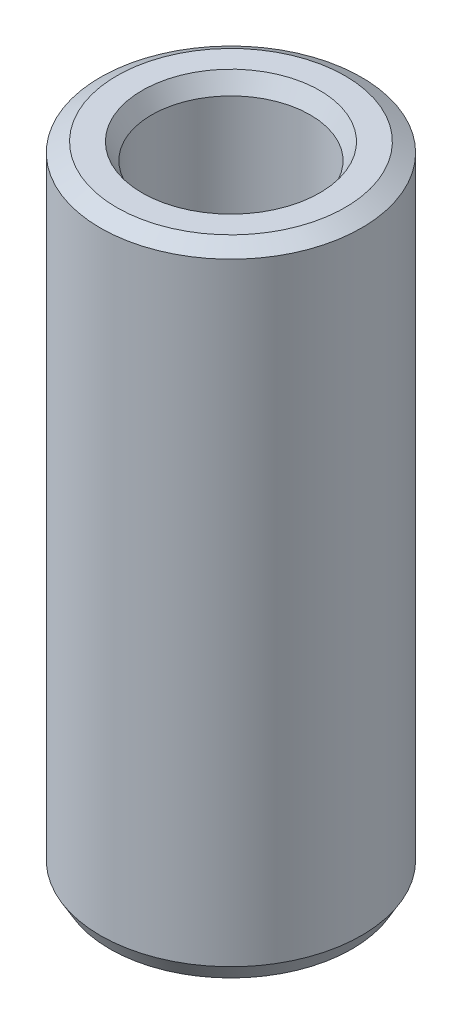
ISO-10303-21;
HEADER;
FILE_DESCRIPTION(('STEP AP214'),'2;1');
FILE_NAME('part.step','',(''),(''),'','','');
FILE_SCHEMA(('AUTOMOTIVE_DESIGN { 1 0 10303 214 1 1 1 1 }'));
ENDSEC;
DATA;
#1=APPLICATION_CONTEXT('core data for automotive mechanical design processes');
#2=APPLICATION_PROTOCOL_DEFINITION('international standard','automotive_design',2000,#1);
#3=PRODUCT_CONTEXT('',#1,'mechanical');
#4=PRODUCT('Part','Part','',(#3));
#5=PRODUCT_RELATED_PRODUCT_CATEGORY('part','',(#4));
#6=PRODUCT_DEFINITION_FORMATION('','',#4);
#7=PRODUCT_DEFINITION_CONTEXT('part definition',#1,'design');
#8=PRODUCT_DEFINITION('design','',#6,#7);
#9=PRODUCT_DEFINITION_SHAPE('','',#8);
#10=(LENGTH_UNIT() NAMED_UNIT(*) SI_UNIT(.MILLI.,.METRE.));
#11=(NAMED_UNIT(*) PLANE_ANGLE_UNIT() SI_UNIT($,.RADIAN.));
#12=(NAMED_UNIT(*) SI_UNIT($,.STERADIAN.) SOLID_ANGLE_UNIT());
#13=UNCERTAINTY_MEASURE_WITH_UNIT(LENGTH_MEASURE(1.E-05),#10,'distance_accuracy_value','');
#14=(GEOMETRIC_REPRESENTATION_CONTEXT(3) GLOBAL_UNCERTAINTY_ASSIGNED_CONTEXT((#13)) GLOBAL_UNIT_ASSIGNED_CONTEXT((#10,
#11,#12)) REPRESENTATION_CONTEXT('',''));
#15=CARTESIAN_POINT('',(0.,0.,0.));
#16=DIRECTION('',(0.,0.,1.));
#17=DIRECTION('',(1.,0.,0.));
#18=AXIS2_PLACEMENT_3D('',#15,#16,#17);
#19=CARTESIAN_POINT('',(0.,171.175300096864,0.));
#20=DIRECTION('',(0.,-1.,0.));
#21=DIRECTION('',(0.,0.,-1.));
#22=AXIS2_PLACEMENT_3D('',#19,#20,#21);
#23=CYLINDRICAL_SURFACE('',#22,35.);
#24=CARTESIAN_POINT('',(0.,4.40254743800553,0.));
#25=DIRECTION('',(0.,1.,0.));
#26=DIRECTION('',(0.,0.,1.));
#27=AXIS2_PLACEMENT_3D('',#24,#25,#26);
#28=CIRCLE('',#27,35.);
#29=CARTESIAN_POINT('',(0.,4.40254743800553,35.));
#30=VERTEX_POINT('',#29);
#31=EDGE_CURVE('E10',#30,#30,#28,.T.);
#32=ORIENTED_EDGE('',*,*,#31,.T.);
#33=EDGE_LOOP('',(#32));
#34=FACE_BOUND('',#33,.T.);
#35=CARTESIAN_POINT('',(0.,168.633488148412,0.));
#36=DIRECTION('',(0.,1.,0.));
#37=DIRECTION('',(0.,0.,1.));
#38=AXIS2_PLACEMENT_3D('',#35,#36,#37);
#39=CIRCLE('',#38,35.);
#40=CARTESIAN_POINT('',(0.,168.633488148412,35.));
#41=VERTEX_POINT('',#40);
#42=EDGE_CURVE('E50',#41,#41,#39,.F.);
#43=ORIENTED_EDGE('',*,*,#42,.T.);
#44=EDGE_LOOP('',(#43));
#45=FACE_BOUND('',#44,.T.);
#46=ADVANCED_FACE('F39',(#34,#45),#23,.T.);
#47=CARTESIAN_POINT('',(0.,171.175300096864,0.));
#48=DIRECTION('',(0.,1.,0.));
#49=DIRECTION('',(0.,0.,1.));
#50=AXIS2_PLACEMENT_3D('',#47,#48,#49);
#51=PLANE('',#50);
#52=CARTESIAN_POINT('',(0.,171.175300096864,0.));
#53=DIRECTION('',(0.,1.,0.));
#54=DIRECTION('',(0.,0.,1.));
#55=AXIS2_PLACEMENT_3D('',#52,#53,#54);
#56=CIRCLE('',#55,23.801715274651);
#57=CARTESIAN_POINT('',(0.,171.175300096864,23.801715274651));
#58=VERTEX_POINT('',#57);
#59=EDGE_CURVE('E58',#58,#58,#56,.F.);
#60=ORIENTED_EDGE('',*,*,#59,.T.);
#61=EDGE_LOOP('',(#60));
#62=FACE_BOUND('',#61,.T.);
#63=CARTESIAN_POINT('',(0.,171.175300096864,0.));
#64=DIRECTION('',(0.,1.,0.));
#65=DIRECTION('',(0.,0.,1.));
#66=AXIS2_PLACEMENT_3D('',#63,#64,#65);
#67=CIRCLE('',#66,30.5974525619944);
#68=CARTESIAN_POINT('',(0.,171.175300096864,30.5974525619944));
#69=VERTEX_POINT('',#68);
#70=EDGE_CURVE('E61',#69,#69,#67,.T.);
#71=ORIENTED_EDGE('',*,*,#70,.T.);
#72=EDGE_LOOP('',(#71));
#73=FACE_BOUND('',#72,.T.);
#74=ADVANCED_FACE('F88',(#62,#73),#51,.T.);
#75=CARTESIAN_POINT('',(0.,0.,0.));
#76=DIRECTION('',(0.,1.,0.));
#77=DIRECTION('',(0.,0.,1.));
#78=AXIS2_PLACEMENT_3D('',#75,#76,#77);
#79=PLANE('',#78);
#80=CARTESIAN_POINT('',(0.,0.,0.));
#81=DIRECTION('',(0.,1.,0.));
#82=DIRECTION('',(0.,0.,1.));
#83=AXIS2_PLACEMENT_3D('',#80,#81,#82);
#84=CIRCLE('',#83,25.662450764204);
#85=CARTESIAN_POINT('',(0.,0.,25.662450764204));
#86=VERTEX_POINT('',#85);
#87=EDGE_CURVE('E51',#86,#86,#84,.T.);
#88=ORIENTED_EDGE('',*,*,#87,.T.);
#89=EDGE_LOOP('',(#88));
#90=FACE_BOUND('',#89,.T.);
#91=CARTESIAN_POINT('',(0.,0.,0.));
#92=DIRECTION('',(0.,1.,0.));
#93=DIRECTION('',(0.,0.,1.));
#94=AXIS2_PLACEMENT_3D('',#91,#92,#93);
#95=CIRCLE('',#94,32.4581880515474);
#96=CARTESIAN_POINT('',(0.,0.,32.4581880515474));
#97=VERTEX_POINT('',#96);
#98=EDGE_CURVE('E54',#97,#97,#95,.F.);
#99=ORIENTED_EDGE('',*,*,#98,.T.);
#100=EDGE_LOOP('',(#99));
#101=FACE_BOUND('',#100,.T.);
#102=ADVANCED_FACE('F83',(#90,#101),#79,.F.);
#103=CARTESIAN_POINT('',(0.,171.175300096864,0.));
#104=DIRECTION('',(0.,-1.,0.));
#105=DIRECTION('',(0.,0.,-1.));
#106=AXIS2_PLACEMENT_3D('',#103,#104,#105);
#107=CYLINDRICAL_SURFACE('',#106,21.2599033261983);
#108=CARTESIAN_POINT('',(0.,166.772752658859,0.));
#109=DIRECTION('',(0.,1.,0.));
#110=DIRECTION('',(0.,0.,1.));
#111=AXIS2_PLACEMENT_3D('',#108,#109,#110);
#112=CIRCLE('',#111,21.2599033261983);
#113=CARTESIAN_POINT('',(0.,166.772752658859,21.2599033261983));
#114=VERTEX_POINT('',#113);
#115=EDGE_CURVE('E67',#114,#114,#112,.T.);
#116=ORIENTED_EDGE('',*,*,#115,.T.);
#117=EDGE_LOOP('',(#116));
#118=FACE_BOUND('',#117,.T.);
#119=CARTESIAN_POINT('',(0.,2.54181194845265,0.));
#120=DIRECTION('',(0.,1.,0.));
#121=DIRECTION('',(0.,0.,1.));
#122=AXIS2_PLACEMENT_3D('',#119,#120,#121);
#123=CIRCLE('',#122,21.2599033261983);
#124=CARTESIAN_POINT('',(0.,2.54181194845265,21.2599033261983));
#125=VERTEX_POINT('',#124);
#126=EDGE_CURVE('E69',#125,#125,#123,.F.);
#127=ORIENTED_EDGE('',*,*,#126,.T.);
#128=EDGE_LOOP('',(#127));
#129=FACE_BOUND('',#128,.T.);
#130=ADVANCED_FACE('F71',(#118,#129),#107,.F.);
#131=CARTESIAN_POINT('',(0.,166.772752658859,0.));
#132=DIRECTION('',(0.,1.,0.));
#133=DIRECTION('',(0.,0.,1.));
#134=AXIS2_PLACEMENT_3D('',#131,#132,#133);
#135=CONICAL_SURFACE('',#134,21.2599033261983,0.523598775598298);
#136=ORIENTED_EDGE('',*,*,#59,.F.);
#137=EDGE_LOOP('',(#136));
#138=FACE_BOUND('',#137,.T.);
#139=ORIENTED_EDGE('',*,*,#115,.F.);
#140=EDGE_LOOP('',(#139));
#141=FACE_BOUND('',#140,.T.);
#142=ADVANCED_FACE('F77',(#138,#141),#135,.F.);
#143=CARTESIAN_POINT('',(0.,0.,0.));
#144=DIRECTION('',(0.,-1.,0.));
#145=DIRECTION('',(0.,0.,-1.));
#146=AXIS2_PLACEMENT_3D('',#143,#144,#145);
#147=CONICAL_SURFACE('',#146,25.662450764204,1.04719755119659);
#148=ORIENTED_EDGE('',*,*,#126,.F.);
#149=EDGE_LOOP('',(#148));
#150=FACE_BOUND('',#149,.T.);
#151=ORIENTED_EDGE('',*,*,#87,.F.);
#152=EDGE_LOOP('',(#151));
#153=FACE_BOUND('',#152,.T.);
#154=ADVANCED_FACE('F73',(#150,#153),#147,.F.);
#155=CARTESIAN_POINT('',(0.,4.40254743800553,0.));
#156=DIRECTION('',(0.,1.,0.));
#157=DIRECTION('',(0.,0.,1.));
#158=AXIS2_PLACEMENT_3D('',#155,#156,#157);
#159=CONICAL_SURFACE('',#158,35.,0.523598775598302);
#160=ORIENTED_EDGE('',*,*,#98,.F.);
#161=EDGE_LOOP('',(#160));
#162=FACE_BOUND('',#161,.T.);
#163=ORIENTED_EDGE('',*,*,#31,.F.);
#164=EDGE_LOOP('',(#163));
#165=FACE_BOUND('',#164,.T.);
#166=ADVANCED_FACE('F76',(#162,#165),#159,.T.);
#167=CARTESIAN_POINT('',(0.,171.175300096864,0.));
#168=DIRECTION('',(0.,-1.,0.));
#169=DIRECTION('',(0.,0.,-1.));
#170=AXIS2_PLACEMENT_3D('',#167,#168,#169);
#171=CONICAL_SURFACE('',#170,30.5974525619944,1.04719755119659);
#172=ORIENTED_EDGE('',*,*,#42,.F.);
#173=EDGE_LOOP('',(#172));
#174=FACE_BOUND('',#173,.T.);
#175=ORIENTED_EDGE('',*,*,#70,.F.);
#176=EDGE_LOOP('',(#175));
#177=FACE_BOUND('',#176,.T.);
#178=ADVANCED_FACE('F45',(#174,#177),#171,.T.);
#179=CLOSED_SHELL('',(#46,#74,#102,#130,#142,#154,#166,#178));
#180=MANIFOLD_SOLID_BREP('B2',#179);
#181=ADVANCED_BREP_SHAPE_REPRESENTATION('',(#18,#180),#14);
#182=SHAPE_DEFINITION_REPRESENTATION(#9,#181);
ENDSEC;
END-ISO-10303-21;
